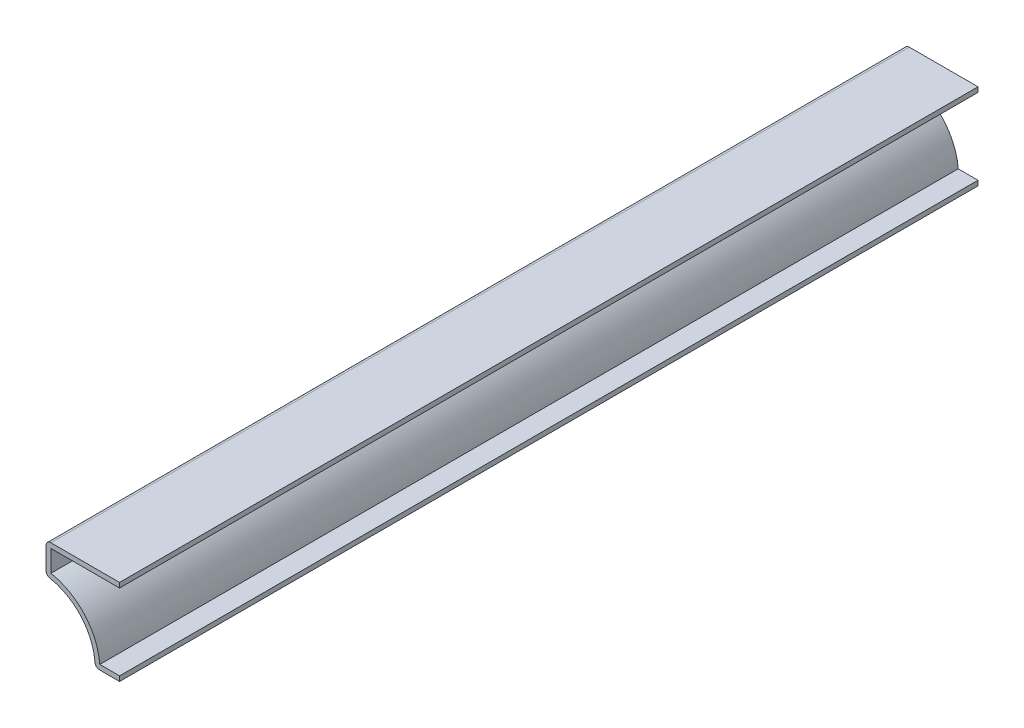
ISO-10303-21;
HEADER;
FILE_DESCRIPTION(('STEP AP214'),'2;1');
FILE_NAME('part.step','',(''),(''),'','','');
FILE_SCHEMA(('AUTOMOTIVE_DESIGN { 1 0 10303 214 1 1 1 1 }'));
ENDSEC;
DATA;
#1=APPLICATION_CONTEXT('core data for automotive mechanical design processes');
#2=APPLICATION_PROTOCOL_DEFINITION('international standard','automotive_design',2000,#1);
#3=PRODUCT_CONTEXT('',#1,'mechanical');
#4=PRODUCT('Part','Part','',(#3));
#5=PRODUCT_RELATED_PRODUCT_CATEGORY('part','',(#4));
#6=PRODUCT_DEFINITION_FORMATION('','',#4);
#7=PRODUCT_DEFINITION_CONTEXT('part definition',#1,'design');
#8=PRODUCT_DEFINITION('design','',#6,#7);
#9=PRODUCT_DEFINITION_SHAPE('','',#8);
#10=(LENGTH_UNIT() NAMED_UNIT(*) SI_UNIT(.MILLI.,.METRE.));
#11=(NAMED_UNIT(*) PLANE_ANGLE_UNIT() SI_UNIT($,.RADIAN.));
#12=(NAMED_UNIT(*) SI_UNIT($,.STERADIAN.) SOLID_ANGLE_UNIT());
#13=UNCERTAINTY_MEASURE_WITH_UNIT(LENGTH_MEASURE(1.E-05),#10,'distance_accuracy_value','');
#14=(GEOMETRIC_REPRESENTATION_CONTEXT(3) GLOBAL_UNCERTAINTY_ASSIGNED_CONTEXT((#13)) GLOBAL_UNIT_ASSIGNED_CONTEXT((#10,
#11,#12)) REPRESENTATION_CONTEXT('',''));
#15=CARTESIAN_POINT('',(0.,0.,0.));
#16=DIRECTION('',(0.,0.,1.));
#17=DIRECTION('',(1.,0.,0.));
#18=AXIS2_PLACEMENT_3D('',#15,#16,#17);
#19=CARTESIAN_POINT('',(-19.05,20.955,-222.25));
#20=DIRECTION('',(0.,-1.,0.));
#21=DIRECTION('',(1.,0.,0.));
#22=AXIS2_PLACEMENT_3D('',#19,#20,#21);
#23=PLANE('',#22);
#24=DIRECTION('',(1.,0.,0.));
#25=VECTOR('',#24,1.);
#26=CARTESIAN_POINT('',(-19.05,20.955,0.));
#27=LINE('',#26,#25);
#28=CARTESIAN_POINT('',(-17.78,20.955,0.));
#29=VERTEX_POINT('',#28);
#30=CARTESIAN_POINT('',(0.,20.955,0.));
#31=VERTEX_POINT('',#30);
#32=EDGE_CURVE('E179',#29,#31,#27,.T.);
#33=ORIENTED_EDGE('',*,*,#32,.F.);
#34=DIRECTION('',(0.,0.,1.));
#35=VECTOR('',#34,1.);
#36=CARTESIAN_POINT('',(-17.78,20.955,-222.25));
#37=LINE('',#36,#35);
#38=CARTESIAN_POINT('',(-17.78,20.955,-222.25));
#39=VERTEX_POINT('',#38);
#40=EDGE_CURVE('E155',#39,#29,#37,.T.);
#41=ORIENTED_EDGE('',*,*,#40,.F.);
#42=DIRECTION('',(1.,0.,0.));
#43=VECTOR('',#42,1.);
#44=CARTESIAN_POINT('',(-19.05,20.955,-222.25));
#45=LINE('',#44,#43);
#46=CARTESIAN_POINT('',(0.,20.955,-222.25));
#47=VERTEX_POINT('',#46);
#48=EDGE_CURVE('E137',#39,#47,#45,.T.);
#49=ORIENTED_EDGE('',*,*,#48,.T.);
#50=DIRECTION('',(0.,0.,1.));
#51=VECTOR('',#50,1.);
#52=CARTESIAN_POINT('',(0.,20.955,-222.25));
#53=LINE('',#52,#51);
#54=EDGE_CURVE('E145',#47,#31,#53,.T.);
#55=ORIENTED_EDGE('',*,*,#54,.T.);
#56=EDGE_LOOP('',(#33,#41,#49,#55));
#57=FACE_BOUND('',#56,.T.);
#58=ADVANCED_FACE('F35',(#57),#23,.T.);
#59=CARTESIAN_POINT('',(-17.78,14.2875,-222.25));
#60=DIRECTION('',(1.,0.,0.));
#61=DIRECTION('',(0.,0.,-1.));
#62=AXIS2_PLACEMENT_3D('',#59,#60,#61);
#63=PLANE('',#62);
#64=DIRECTION('',(0.,1.,0.));
#65=VECTOR('',#64,1.);
#66=CARTESIAN_POINT('',(-17.78,14.2875,0.));
#67=LINE('',#66,#65);
#68=CARTESIAN_POINT('',(-17.78,15.3813139998428,0.));
#69=VERTEX_POINT('',#68);
#70=EDGE_CURVE('E156',#69,#29,#67,.T.);
#71=ORIENTED_EDGE('',*,*,#70,.F.);
#72=DIRECTION('',(0.,0.,1.));
#73=VECTOR('',#72,1.);
#74=CARTESIAN_POINT('',(-17.78,15.3813139998428,-222.25));
#75=LINE('',#74,#73);
#76=CARTESIAN_POINT('',(-17.78,15.3813139998428,-222.25));
#77=VERTEX_POINT('',#76);
#78=EDGE_CURVE('E201',#77,#69,#75,.T.);
#79=ORIENTED_EDGE('',*,*,#78,.F.);
#80=DIRECTION('',(0.,1.,0.));
#81=VECTOR('',#80,1.);
#82=CARTESIAN_POINT('',(-17.78,14.2875,-222.25));
#83=LINE('',#82,#81);
#84=EDGE_CURVE('E153',#77,#39,#83,.T.);
#85=ORIENTED_EDGE('',*,*,#84,.T.);
#86=ORIENTED_EDGE('',*,*,#40,.T.);
#87=EDGE_LOOP('',(#71,#79,#85,#86));
#88=FACE_BOUND('',#87,.T.);
#89=ADVANCED_FACE('F245',(#88),#63,.T.);
#90=CARTESIAN_POINT('',(-20.6372262883842,0.0884377436584805,-222.25));
#91=DIRECTION('',(0.,0.,1.));
#92=DIRECTION('',(1.,0.,0.));
#93=AXIS2_PLACEMENT_3D('',#90,#91,#92);
#94=CYLINDRICAL_SURFACE('',#93,15.5575);
#95=CARTESIAN_POINT('',(-20.6372262883842,0.0884377436584805,0.));
#96=DIRECTION('',(0.,0.,1.));
#97=DIRECTION('',(1.,0.,0.));
#98=AXIS2_PLACEMENT_3D('',#95,#96,#97);
#99=CIRCLE('',#98,15.5575);
#100=CARTESIAN_POINT('',(-5.12465987001263,1.27,0.));
#101=VERTEX_POINT('',#100);
#102=EDGE_CURVE('E159',#101,#69,#99,.T.);
#103=ORIENTED_EDGE('',*,*,#102,.F.);
#104=DIRECTION('',(0.,0.,1.));
#105=VECTOR('',#104,1.);
#106=CARTESIAN_POINT('',(-5.12465987001263,1.27,-222.25));
#107=LINE('',#106,#105);
#108=CARTESIAN_POINT('',(-5.12465987001263,1.27,-222.25));
#109=VERTEX_POINT('',#108);
#110=EDGE_CURVE('E203',#109,#101,#107,.T.);
#111=ORIENTED_EDGE('',*,*,#110,.F.);
#112=CARTESIAN_POINT('',(-20.6372262883842,0.0884377436584805,-222.25));
#113=DIRECTION('',(0.,0.,1.));
#114=DIRECTION('',(1.,0.,0.));
#115=AXIS2_PLACEMENT_3D('',#112,#113,#114);
#116=CIRCLE('',#115,15.5575);
#117=EDGE_CURVE('E175',#109,#77,#116,.T.);
#118=ORIENTED_EDGE('',*,*,#117,.T.);
#119=ORIENTED_EDGE('',*,*,#78,.T.);
#120=EDGE_LOOP('',(#103,#111,#118,#119));
#121=FACE_BOUND('',#120,.T.);
#122=ADVANCED_FACE('F283',(#121),#94,.T.);
#123=CARTESIAN_POINT('',(0.,1.27,-222.25));
#124=DIRECTION('',(0.,1.,0.));
#125=DIRECTION('',(0.,0.,1.));
#126=AXIS2_PLACEMENT_3D('',#123,#124,#125);
#127=PLANE('',#126);
#128=DIRECTION('',(1.,0.,0.));
#129=VECTOR('',#128,1.);
#130=CARTESIAN_POINT('',(0.,1.27,0.));
#131=LINE('',#130,#129);
#132=CARTESIAN_POINT('',(0.,1.27,0.));
#133=VERTEX_POINT('',#132);
#134=EDGE_CURVE('E194',#133,#101,#131,.F.);
#135=ORIENTED_EDGE('',*,*,#134,.F.);
#136=DIRECTION('',(0.,0.,1.));
#137=VECTOR('',#136,1.);
#138=CARTESIAN_POINT('',(0.,1.27,-222.25));
#139=LINE('',#138,#137);
#140=CARTESIAN_POINT('',(0.,1.27,-222.25));
#141=VERTEX_POINT('',#140);
#142=EDGE_CURVE('E205',#141,#133,#139,.T.);
#143=ORIENTED_EDGE('',*,*,#142,.F.);
#144=DIRECTION('',(1.,0.,0.));
#145=VECTOR('',#144,1.);
#146=CARTESIAN_POINT('',(0.,1.27,-222.25));
#147=LINE('',#146,#145);
#148=EDGE_CURVE('E172',#141,#109,#147,.F.);
#149=ORIENTED_EDGE('',*,*,#148,.T.);
#150=ORIENTED_EDGE('',*,*,#110,.T.);
#151=EDGE_LOOP('',(#135,#143,#149,#150));
#152=FACE_BOUND('',#151,.T.);
#153=ADVANCED_FACE('F251',(#152),#127,.T.);
#154=CARTESIAN_POINT('',(0.,1.27,-222.25));
#155=DIRECTION('',(-1.,0.,0.));
#156=DIRECTION('',(0.,0.,1.));
#157=AXIS2_PLACEMENT_3D('',#154,#155,#156);
#158=PLANE('',#157);
#159=DIRECTION('',(0.,-1.,0.));
#160=VECTOR('',#159,1.);
#161=CARTESIAN_POINT('',(0.,1.27,0.));
#162=LINE('',#161,#160);
#163=CARTESIAN_POINT('',(0.,0.,0.));
#164=VERTEX_POINT('',#163);
#165=EDGE_CURVE('E192',#133,#164,#162,.T.);
#166=ORIENTED_EDGE('',*,*,#165,.T.);
#167=DIRECTION('',(0.,0.,1.));
#168=VECTOR('',#167,1.);
#169=CARTESIAN_POINT('',(0.,0.,-222.25));
#170=LINE('',#169,#168);
#171=CARTESIAN_POINT('',(0.,0.,-222.25));
#172=VERTEX_POINT('',#171);
#173=EDGE_CURVE('E207',#172,#164,#170,.T.);
#174=ORIENTED_EDGE('',*,*,#173,.F.);
#175=DIRECTION('',(0.,-1.,0.));
#176=VECTOR('',#175,1.);
#177=CARTESIAN_POINT('',(0.,1.27,-222.25));
#178=LINE('',#177,#176);
#179=EDGE_CURVE('E170',#141,#172,#178,.T.);
#180=ORIENTED_EDGE('',*,*,#179,.F.);
#181=ORIENTED_EDGE('',*,*,#142,.T.);
#182=EDGE_LOOP('',(#166,#174,#180,#181));
#183=FACE_BOUND('',#182,.T.);
#184=ADVANCED_FACE('F256',(#183),#158,.F.);
#185=CARTESIAN_POINT('',(0.,0.,-222.25));
#186=DIRECTION('',(0.,1.,0.));
#187=DIRECTION('',(0.,0.,1.));
#188=AXIS2_PLACEMENT_3D('',#185,#186,#187);
#189=PLANE('',#188);
#190=DIRECTION('',(-1.,0.,0.));
#191=VECTOR('',#190,1.);
#192=CARTESIAN_POINT('',(0.,0.,0.));
#193=LINE('',#192,#191);
#194=CARTESIAN_POINT('',(-5.12465987001263,0.,0.));
#195=VERTEX_POINT('',#194);
#196=EDGE_CURVE('E189',#164,#195,#193,.T.);
#197=ORIENTED_EDGE('',*,*,#196,.T.);
#198=DIRECTION('',(0.,0.,1.));
#199=VECTOR('',#198,1.);
#200=CARTESIAN_POINT('',(-5.12465987001263,0.,-222.25));
#201=LINE('',#200,#199);
#202=CARTESIAN_POINT('',(-5.12465987001263,0.,-222.25));
#203=VERTEX_POINT('',#202);
#204=EDGE_CURVE('E221',#195,#203,#201,.F.);
#205=ORIENTED_EDGE('',*,*,#204,.T.);
#206=DIRECTION('',(-1.,0.,0.));
#207=VECTOR('',#206,1.);
#208=CARTESIAN_POINT('',(0.,0.,-222.25));
#209=LINE('',#208,#207);
#210=EDGE_CURVE('E168',#172,#203,#209,.T.);
#211=ORIENTED_EDGE('',*,*,#210,.F.);
#212=ORIENTED_EDGE('',*,*,#173,.T.);
#213=EDGE_LOOP('',(#197,#205,#211,#212));
#214=FACE_BOUND('',#213,.T.);
#215=ADVANCED_FACE('F269',(#214),#189,.F.);
#216=CARTESIAN_POINT('',(-20.6372262883842,0.0884377436584805,-222.25));
#217=DIRECTION('',(0.,0.,1.));
#218=DIRECTION('',(1.,0.,0.));
#219=AXIS2_PLACEMENT_3D('',#216,#217,#218);
#220=CYLINDRICAL_SURFACE('',#219,14.2875);
#221=CARTESIAN_POINT('',(-20.6372262883842,0.0884377436584805,-222.25));
#222=DIRECTION('',(0.,0.,1.));
#223=DIRECTION('',(1.,0.,0.));
#224=AXIS2_PLACEMENT_3D('',#221,#222,#223);
#225=CIRCLE('',#224,14.2875);
#226=CARTESIAN_POINT('',(-6.39099182253276,1.17354593825784,-222.25));
#227=VERTEX_POINT('',#226);
#228=CARTESIAN_POINT('',(-18.0132429623171,14.1329159381135,-222.25));
#229=VERTEX_POINT('',#228);
#230=EDGE_CURVE('E165',#227,#229,#225,.T.);
#231=ORIENTED_EDGE('',*,*,#230,.F.);
#232=DIRECTION('',(0.,0.,1.));
#233=VECTOR('',#232,1.);
#234=CARTESIAN_POINT('',(-6.39099182253276,1.17354593825784,-222.25));
#235=LINE('',#234,#233);
#236=CARTESIAN_POINT('',(-6.39099182253276,1.17354593825784,0.));
#237=VERTEX_POINT('',#236);
#238=EDGE_CURVE('E212',#227,#237,#235,.T.);
#239=ORIENTED_EDGE('',*,*,#238,.T.);
#240=CARTESIAN_POINT('',(-20.6372262883842,0.0884377436584805,0.));
#241=DIRECTION('',(0.,0.,1.));
#242=DIRECTION('',(1.,0.,0.));
#243=AXIS2_PLACEMENT_3D('',#240,#241,#242);
#244=CIRCLE('',#243,14.2875);
#245=CARTESIAN_POINT('',(-18.0132429623171,14.1329159381135,0.));
#246=VERTEX_POINT('',#245);
#247=EDGE_CURVE('E186',#237,#246,#244,.T.);
#248=ORIENTED_EDGE('',*,*,#247,.T.);
#249=DIRECTION('',(0.,0.,1.));
#250=VECTOR('',#249,1.);
#251=CARTESIAN_POINT('',(-18.0132429623171,14.1329159381135,-222.25));
#252=LINE('',#251,#250);
#253=EDGE_CURVE('E200',#246,#229,#252,.F.);
#254=ORIENTED_EDGE('',*,*,#253,.T.);
#255=EDGE_LOOP('',(#231,#239,#248,#254));
#256=FACE_BOUND('',#255,.T.);
#257=ADVANCED_FACE('F266',(#256),#220,.F.);
#258=CARTESIAN_POINT('',(-19.05,14.2875,-222.25));
#259=DIRECTION('',(1.,0.,0.));
#260=DIRECTION('',(0.,0.,-1.));
#261=AXIS2_PLACEMENT_3D('',#258,#259,#260);
#262=PLANE('',#261);
#263=DIRECTION('',(0.,1.,0.));
#264=VECTOR('',#263,1.);
#265=CARTESIAN_POINT('',(-19.05,14.2875,-222.25));
#266=LINE('',#265,#264);
#267=CARTESIAN_POINT('',(-19.05,15.3813139998428,-222.25));
#268=VERTEX_POINT('',#267);
#269=CARTESIAN_POINT('',(-19.05,20.955,-222.25));
#270=VERTEX_POINT('',#269);
#271=EDGE_CURVE('E163',#268,#270,#266,.T.);
#272=ORIENTED_EDGE('',*,*,#271,.F.);
#273=DIRECTION('',(0.,0.,1.));
#274=VECTOR('',#273,1.);
#275=CARTESIAN_POINT('',(-19.05,15.3813139998428,-222.25));
#276=LINE('',#275,#274);
#277=CARTESIAN_POINT('',(-19.05,15.3813139998428,0.));
#278=VERTEX_POINT('',#277);
#279=EDGE_CURVE('E43',#268,#278,#276,.T.);
#280=ORIENTED_EDGE('',*,*,#279,.T.);
#281=DIRECTION('',(0.,1.,0.));
#282=VECTOR('',#281,1.);
#283=CARTESIAN_POINT('',(-19.05,14.2875,0.));
#284=LINE('',#283,#282);
#285=CARTESIAN_POINT('',(-19.05,20.955,0.));
#286=VERTEX_POINT('',#285);
#287=EDGE_CURVE('E184',#278,#286,#284,.T.);
#288=ORIENTED_EDGE('',*,*,#287,.T.);
#289=DIRECTION('',(0.,0.,1.));
#290=VECTOR('',#289,1.);
#291=CARTESIAN_POINT('',(-19.05,20.955,-222.25));
#292=LINE('',#291,#290);
#293=EDGE_CURVE('E58',#286,#270,#292,.F.);
#294=ORIENTED_EDGE('',*,*,#293,.T.);
#295=EDGE_LOOP('',(#272,#280,#288,#294));
#296=FACE_BOUND('',#295,.T.);
#297=ADVANCED_FACE('F231',(#296),#262,.F.);
#298=CARTESIAN_POINT('',(-19.05,22.225,-222.25));
#299=DIRECTION('',(0.,-1.,0.));
#300=DIRECTION('',(1.,0.,0.));
#301=AXIS2_PLACEMENT_3D('',#298,#299,#300);
#302=PLANE('',#301);
#303=DIRECTION('',(1.,0.,0.));
#304=VECTOR('',#303,1.);
#305=CARTESIAN_POINT('',(-19.05,22.225,-222.25));
#306=LINE('',#305,#304);
#307=CARTESIAN_POINT('',(-17.78,22.225,-222.25));
#308=VERTEX_POINT('',#307);
#309=CARTESIAN_POINT('',(0.,22.225,-222.25));
#310=VERTEX_POINT('',#309);
#311=EDGE_CURVE('E139',#308,#310,#306,.T.);
#312=ORIENTED_EDGE('',*,*,#311,.F.);
#313=DIRECTION('',(0.,0.,1.));
#314=VECTOR('',#313,1.);
#315=CARTESIAN_POINT('',(-17.78,22.225,-222.25));
#316=LINE('',#315,#314);
#317=CARTESIAN_POINT('',(-17.78,22.225,0.));
#318=VERTEX_POINT('',#317);
#319=EDGE_CURVE('E11',#308,#318,#316,.T.);
#320=ORIENTED_EDGE('',*,*,#319,.T.);
#321=DIRECTION('',(1.,0.,0.));
#322=VECTOR('',#321,1.);
#323=CARTESIAN_POINT('',(-19.05,22.225,0.));
#324=LINE('',#323,#322);
#325=CARTESIAN_POINT('',(0.,22.225,0.));
#326=VERTEX_POINT('',#325);
#327=EDGE_CURVE('E182',#318,#326,#324,.T.);
#328=ORIENTED_EDGE('',*,*,#327,.T.);
#329=DIRECTION('',(0.,0.,1.));
#330=VECTOR('',#329,1.);
#331=CARTESIAN_POINT('',(0.,22.225,-222.25));
#332=LINE('',#331,#330);
#333=EDGE_CURVE('E152',#310,#326,#332,.T.);
#334=ORIENTED_EDGE('',*,*,#333,.F.);
#335=EDGE_LOOP('',(#312,#320,#328,#334));
#336=FACE_BOUND('',#335,.T.);
#337=ADVANCED_FACE('F241',(#336),#302,.F.);
#338=CARTESIAN_POINT('',(0.,22.225,-222.25));
#339=DIRECTION('',(-1.,0.,0.));
#340=DIRECTION('',(0.,0.,1.));
#341=AXIS2_PLACEMENT_3D('',#338,#339,#340);
#342=PLANE('',#341);
#343=DIRECTION('',(0.,-1.,0.));
#344=VECTOR('',#343,1.);
#345=CARTESIAN_POINT('',(0.,22.225,0.));
#346=LINE('',#345,#344);
#347=EDGE_CURVE('E148',#326,#31,#346,.T.);
#348=ORIENTED_EDGE('',*,*,#347,.T.);
#349=ORIENTED_EDGE('',*,*,#54,.F.);
#350=DIRECTION('',(0.,-1.,0.));
#351=VECTOR('',#350,1.);
#352=CARTESIAN_POINT('',(0.,22.225,-222.25));
#353=LINE('',#352,#351);
#354=EDGE_CURVE('E131',#310,#47,#353,.T.);
#355=ORIENTED_EDGE('',*,*,#354,.F.);
#356=ORIENTED_EDGE('',*,*,#333,.T.);
#357=EDGE_LOOP('',(#348,#349,#355,#356));
#358=FACE_BOUND('',#357,.T.);
#359=ADVANCED_FACE('F146',(#358),#342,.F.);
#360=CARTESIAN_POINT('',(-20.6372262883842,0.0884377436584805,-222.25));
#361=DIRECTION('',(0.,0.,1.));
#362=DIRECTION('',(1.,0.,0.));
#363=AXIS2_PLACEMENT_3D('',#360,#361,#362);
#364=PLANE('',#363);
#365=ORIENTED_EDGE('',*,*,#210,.T.);
#366=CARTESIAN_POINT('',(-5.12465987001263,1.27,-222.25));
#367=DIRECTION('',(0.,0.,1.));
#368=DIRECTION('',(1.,0.,0.));
#369=AXIS2_PLACEMENT_3D('',#366,#367,#368);
#370=CIRCLE('',#369,1.27);
#371=EDGE_CURVE('E226',#203,#227,#370,.F.);
#372=ORIENTED_EDGE('',*,*,#371,.T.);
#373=ORIENTED_EDGE('',*,*,#230,.T.);
#374=CARTESIAN_POINT('',(-17.78,15.3813139998428,-222.25));
#375=DIRECTION('',(0.,0.,1.));
#376=DIRECTION('',(1.,0.,0.));
#377=AXIS2_PLACEMENT_3D('',#374,#375,#376);
#378=CIRCLE('',#377,1.27);
#379=EDGE_CURVE('E224',#229,#268,#378,.F.);
#380=ORIENTED_EDGE('',*,*,#379,.T.);
#381=ORIENTED_EDGE('',*,*,#271,.T.);
#382=CARTESIAN_POINT('',(-17.78,20.955,-222.25));
#383=DIRECTION('',(0.,0.,1.));
#384=DIRECTION('',(1.,0.,0.));
#385=AXIS2_PLACEMENT_3D('',#382,#383,#384);
#386=CIRCLE('',#385,1.27);
#387=EDGE_CURVE('E50',#270,#308,#386,.F.);
#388=ORIENTED_EDGE('',*,*,#387,.T.);
#389=ORIENTED_EDGE('',*,*,#311,.T.);
#390=ORIENTED_EDGE('',*,*,#354,.T.);
#391=ORIENTED_EDGE('',*,*,#48,.F.);
#392=ORIENTED_EDGE('',*,*,#84,.F.);
#393=ORIENTED_EDGE('',*,*,#117,.F.);
#394=ORIENTED_EDGE('',*,*,#148,.F.);
#395=ORIENTED_EDGE('',*,*,#179,.T.);
#396=EDGE_LOOP('',(#365,#372,#373,#380,#381,#388,#389,#390,#391,#392,#393,#394,#395));
#397=FACE_BOUND('',#396,.T.);
#398=ADVANCED_FACE('F134',(#397),#364,.F.);
#399=CARTESIAN_POINT('',(-20.6372262883842,0.0884377436584805,0.));
#400=DIRECTION('',(0.,0.,1.));
#401=DIRECTION('',(1.,0.,0.));
#402=AXIS2_PLACEMENT_3D('',#399,#400,#401);
#403=PLANE('',#402);
#404=ORIENTED_EDGE('',*,*,#247,.F.);
#405=CARTESIAN_POINT('',(-5.12465987001263,1.27,0.));
#406=DIRECTION('',(0.,0.,1.));
#407=DIRECTION('',(1.,0.,0.));
#408=AXIS2_PLACEMENT_3D('',#405,#406,#407);
#409=CIRCLE('',#408,1.27);
#410=EDGE_CURVE('E219',#237,#195,#409,.T.);
#411=ORIENTED_EDGE('',*,*,#410,.T.);
#412=ORIENTED_EDGE('',*,*,#196,.F.);
#413=ORIENTED_EDGE('',*,*,#165,.F.);
#414=ORIENTED_EDGE('',*,*,#134,.T.);
#415=ORIENTED_EDGE('',*,*,#102,.T.);
#416=ORIENTED_EDGE('',*,*,#70,.T.);
#417=ORIENTED_EDGE('',*,*,#32,.T.);
#418=ORIENTED_EDGE('',*,*,#347,.F.);
#419=ORIENTED_EDGE('',*,*,#327,.F.);
#420=CARTESIAN_POINT('',(-17.78,20.955,0.));
#421=DIRECTION('',(0.,0.,1.));
#422=DIRECTION('',(1.,0.,0.));
#423=AXIS2_PLACEMENT_3D('',#420,#421,#422);
#424=CIRCLE('',#423,1.27);
#425=EDGE_CURVE('E215',#318,#286,#424,.T.);
#426=ORIENTED_EDGE('',*,*,#425,.T.);
#427=ORIENTED_EDGE('',*,*,#287,.F.);
#428=CARTESIAN_POINT('',(-17.78,15.3813139998428,0.));
#429=DIRECTION('',(0.,0.,1.));
#430=DIRECTION('',(1.,0.,0.));
#431=AXIS2_PLACEMENT_3D('',#428,#429,#430);
#432=CIRCLE('',#431,1.27);
#433=EDGE_CURVE('E217',#278,#246,#432,.T.);
#434=ORIENTED_EDGE('',*,*,#433,.T.);
#435=EDGE_LOOP('',(#404,#411,#412,#413,#414,#415,#416,#417,#418,#419,#426,#427,#434));
#436=FACE_BOUND('',#435,.T.);
#437=ADVANCED_FACE('F236',(#436),#403,.T.);
#438=CARTESIAN_POINT('',(-5.12465987001263,1.27,-222.25));
#439=DIRECTION('',(0.,0.,1.));
#440=DIRECTION('',(1.,0.,0.));
#441=AXIS2_PLACEMENT_3D('',#438,#439,#440);
#442=CYLINDRICAL_SURFACE('',#441,1.27);
#443=ORIENTED_EDGE('',*,*,#371,.F.);
#444=ORIENTED_EDGE('',*,*,#204,.F.);
#445=ORIENTED_EDGE('',*,*,#410,.F.);
#446=ORIENTED_EDGE('',*,*,#238,.F.);
#447=EDGE_LOOP('',(#443,#444,#445,#446));
#448=FACE_BOUND('',#447,.T.);
#449=ADVANCED_FACE('F264',(#448),#442,.T.);
#450=CARTESIAN_POINT('',(-17.78,15.3813139998428,-222.25));
#451=DIRECTION('',(0.,0.,1.));
#452=DIRECTION('',(1.,0.,0.));
#453=AXIS2_PLACEMENT_3D('',#450,#451,#452);
#454=CYLINDRICAL_SURFACE('',#453,1.27);
#455=ORIENTED_EDGE('',*,*,#379,.F.);
#456=ORIENTED_EDGE('',*,*,#253,.F.);
#457=ORIENTED_EDGE('',*,*,#433,.F.);
#458=ORIENTED_EDGE('',*,*,#279,.F.);
#459=EDGE_LOOP('',(#455,#456,#457,#458));
#460=FACE_BOUND('',#459,.T.);
#461=ADVANCED_FACE('F289',(#460),#454,.T.);
#462=CARTESIAN_POINT('',(-17.78,20.955,-222.25));
#463=DIRECTION('',(0.,0.,1.));
#464=DIRECTION('',(1.,0.,0.));
#465=AXIS2_PLACEMENT_3D('',#462,#463,#464);
#466=CYLINDRICAL_SURFACE('',#465,1.27);
#467=ORIENTED_EDGE('',*,*,#387,.F.);
#468=ORIENTED_EDGE('',*,*,#293,.F.);
#469=ORIENTED_EDGE('',*,*,#425,.F.);
#470=ORIENTED_EDGE('',*,*,#319,.F.);
#471=EDGE_LOOP('',(#467,#468,#469,#470));
#472=FACE_BOUND('',#471,.T.);
#473=ADVANCED_FACE('F37',(#472),#466,.T.);
#474=CLOSED_SHELL('',(#58,#89,#122,#153,#184,#215,#257,#297,#337,#359,#398,#437,#449,#461,#473));
#475=MANIFOLD_SOLID_BREP('B2',#474);
#476=ADVANCED_BREP_SHAPE_REPRESENTATION('',(#18,#475),#14);
#477=SHAPE_DEFINITION_REPRESENTATION(#9,#476);
ENDSEC;
END-ISO-10303-21;
